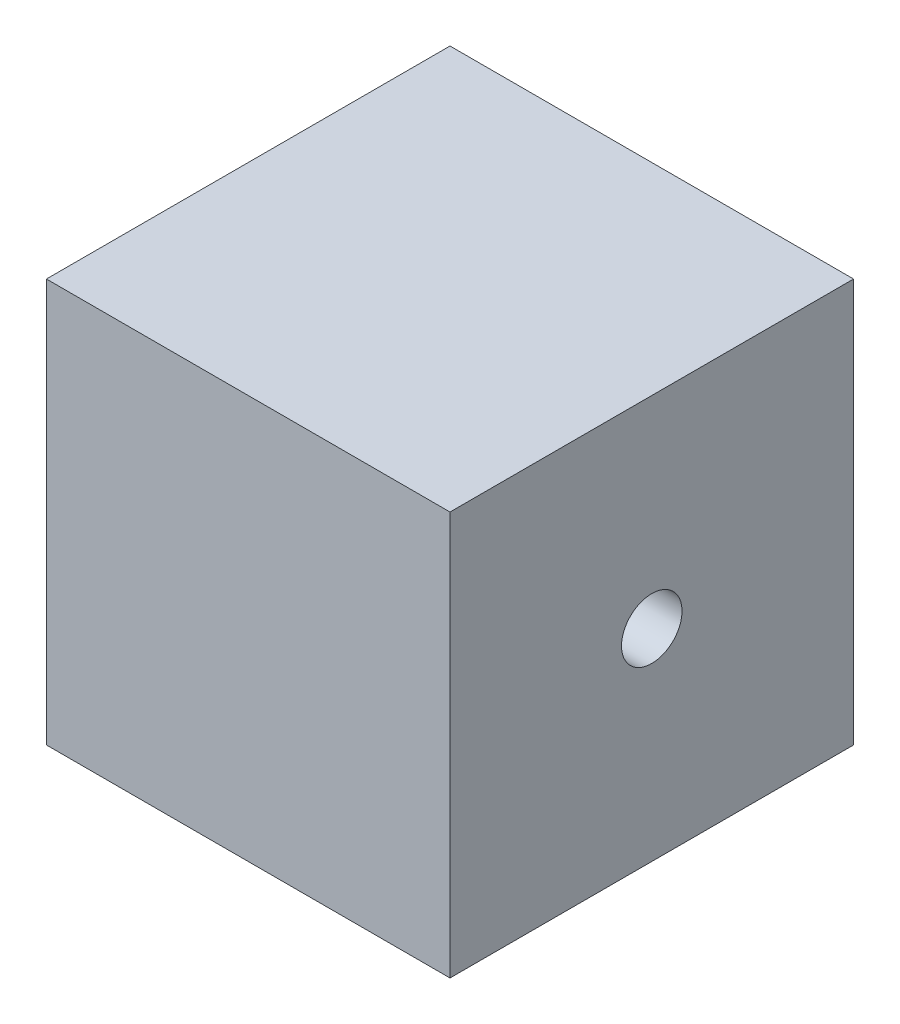
ISO-10303-21;
HEADER;
FILE_DESCRIPTION(('STEP AP214'),'2;1');
FILE_NAME('part.step','',(''),(''),'','','');
FILE_SCHEMA(('AUTOMOTIVE_DESIGN { 1 0 10303 214 1 1 1 1 }'));
ENDSEC;
DATA;
#1=APPLICATION_CONTEXT('core data for automotive mechanical design processes');
#2=APPLICATION_PROTOCOL_DEFINITION('international standard','automotive_design',2000,#1);
#3=PRODUCT_CONTEXT('',#1,'mechanical');
#4=PRODUCT('Part','Part','',(#3));
#5=PRODUCT_RELATED_PRODUCT_CATEGORY('part','',(#4));
#6=PRODUCT_DEFINITION_FORMATION('','',#4);
#7=PRODUCT_DEFINITION_CONTEXT('part definition',#1,'design');
#8=PRODUCT_DEFINITION('design','',#6,#7);
#9=PRODUCT_DEFINITION_SHAPE('','',#8);
#10=(LENGTH_UNIT() NAMED_UNIT(*) SI_UNIT(.MILLI.,.METRE.));
#11=(NAMED_UNIT(*) PLANE_ANGLE_UNIT() SI_UNIT($,.RADIAN.));
#12=(NAMED_UNIT(*) SI_UNIT($,.STERADIAN.) SOLID_ANGLE_UNIT());
#13=UNCERTAINTY_MEASURE_WITH_UNIT(LENGTH_MEASURE(1.E-05),#10,'distance_accuracy_value','');
#14=(GEOMETRIC_REPRESENTATION_CONTEXT(3) GLOBAL_UNCERTAINTY_ASSIGNED_CONTEXT((#13)) GLOBAL_UNIT_ASSIGNED_CONTEXT((#10,
#11,#12)) REPRESENTATION_CONTEXT('',''));
#15=CARTESIAN_POINT('',(0.,0.,0.));
#16=DIRECTION('',(0.,0.,1.));
#17=DIRECTION('',(1.,0.,0.));
#18=AXIS2_PLACEMENT_3D('',#15,#16,#17);
#19=CARTESIAN_POINT('',(-10.,20.,9.99999999999999));
#20=DIRECTION('',(1.,0.,0.));
#21=DIRECTION('',(0.,0.,-1.));
#22=AXIS2_PLACEMENT_3D('',#19,#20,#21);
#23=PLANE('',#22);
#24=CARTESIAN_POINT('',(-10.,10.,0.));
#25=DIRECTION('',(-1.,0.,0.));
#26=DIRECTION('',(0.,0.,1.));
#27=AXIS2_PLACEMENT_3D('',#24,#25,#26);
#28=CIRCLE('',#27,1.5);
#29=CARTESIAN_POINT('',(-10.,10.,1.5));
#30=VERTEX_POINT('',#29);
#31=EDGE_CURVE('E110',#30,#30,#28,.T.);
#32=ORIENTED_EDGE('',*,*,#31,.F.);
#33=EDGE_LOOP('',(#32));
#34=FACE_BOUND('',#33,.T.);
#35=DIRECTION('',(0.,0.,1.));
#36=VECTOR('',#35,1.);
#37=CARTESIAN_POINT('',(-10.,0.,9.99999999999999));
#38=LINE('',#37,#36);
#39=CARTESIAN_POINT('',(-10.,0.,-9.99999999999999));
#40=VERTEX_POINT('',#39);
#41=CARTESIAN_POINT('',(-10.,0.,9.99999999999999));
#42=VERTEX_POINT('',#41);
#43=EDGE_CURVE('E96',#40,#42,#38,.T.);
#44=ORIENTED_EDGE('',*,*,#43,.T.);
#45=DIRECTION('',(0.,-1.,0.));
#46=VECTOR('',#45,1.);
#47=CARTESIAN_POINT('',(-10.,20.,9.99999999999999));
#48=LINE('',#47,#46);
#49=CARTESIAN_POINT('',(-10.,20.,9.99999999999999));
#50=VERTEX_POINT('',#49);
#51=EDGE_CURVE('E11',#50,#42,#48,.T.);
#52=ORIENTED_EDGE('',*,*,#51,.F.);
#53=DIRECTION('',(0.,0.,1.));
#54=VECTOR('',#53,1.);
#55=CARTESIAN_POINT('',(-10.,20.,9.99999999999999));
#56=LINE('',#55,#54);
#57=CARTESIAN_POINT('',(-10.,20.,-9.99999999999999));
#58=VERTEX_POINT('',#57);
#59=EDGE_CURVE('E84',#58,#50,#56,.T.);
#60=ORIENTED_EDGE('',*,*,#59,.F.);
#61=DIRECTION('',(0.,-1.,0.));
#62=VECTOR('',#61,1.);
#63=CARTESIAN_POINT('',(-10.,20.,-9.99999999999999));
#64=LINE('',#63,#62);
#65=EDGE_CURVE('E92',#58,#40,#64,.T.);
#66=ORIENTED_EDGE('',*,*,#65,.T.);
#67=EDGE_LOOP('',(#44,#52,#60,#66));
#68=FACE_BOUND('',#67,.T.);
#69=ADVANCED_FACE('F33',(#34,#68),#23,.F.);
#70=CARTESIAN_POINT('',(10.,20.,9.99999999999999));
#71=DIRECTION('',(0.,0.,-1.));
#72=DIRECTION('',(-1.,0.,0.));
#73=AXIS2_PLACEMENT_3D('',#70,#71,#72);
#74=PLANE('',#73);
#75=DIRECTION('',(1.,0.,0.));
#76=VECTOR('',#75,1.);
#77=CARTESIAN_POINT('',(10.,0.,9.99999999999999));
#78=LINE('',#77,#76);
#79=CARTESIAN_POINT('',(10.,0.,9.99999999999999));
#80=VERTEX_POINT('',#79);
#81=EDGE_CURVE('E88',#42,#80,#78,.T.);
#82=ORIENTED_EDGE('',*,*,#81,.T.);
#83=DIRECTION('',(0.,-1.,0.));
#84=VECTOR('',#83,1.);
#85=CARTESIAN_POINT('',(10.,20.,9.99999999999999));
#86=LINE('',#85,#84);
#87=CARTESIAN_POINT('',(10.,20.,9.99999999999999));
#88=VERTEX_POINT('',#87);
#89=EDGE_CURVE('E41',#88,#80,#86,.T.);
#90=ORIENTED_EDGE('',*,*,#89,.F.);
#91=DIRECTION('',(1.,0.,0.));
#92=VECTOR('',#91,1.);
#93=CARTESIAN_POINT('',(10.,20.,9.99999999999999));
#94=LINE('',#93,#92);
#95=EDGE_CURVE('E79',#50,#88,#94,.T.);
#96=ORIENTED_EDGE('',*,*,#95,.F.);
#97=ORIENTED_EDGE('',*,*,#51,.T.);
#98=EDGE_LOOP('',(#82,#90,#96,#97));
#99=FACE_BOUND('',#98,.T.);
#100=ADVANCED_FACE('F87',(#99),#74,.F.);
#101=CARTESIAN_POINT('',(10.,20.,9.99999999999999));
#102=DIRECTION('',(-1.,0.,0.));
#103=DIRECTION('',(0.,0.,1.));
#104=AXIS2_PLACEMENT_3D('',#101,#102,#103);
#105=PLANE('',#104);
#106=CARTESIAN_POINT('',(10.,10.,0.));
#107=DIRECTION('',(-1.,0.,0.));
#108=DIRECTION('',(0.,0.,1.));
#109=AXIS2_PLACEMENT_3D('',#106,#107,#108);
#110=CIRCLE('',#109,1.5);
#111=CARTESIAN_POINT('',(10.,10.,1.5));
#112=VERTEX_POINT('',#111);
#113=EDGE_CURVE('E99',#112,#112,#110,.T.);
#114=ORIENTED_EDGE('',*,*,#113,.T.);
#115=EDGE_LOOP('',(#114));
#116=FACE_BOUND('',#115,.T.);
#117=DIRECTION('',(0.,0.,-1.));
#118=VECTOR('',#117,1.);
#119=CARTESIAN_POINT('',(10.,0.,9.99999999999999));
#120=LINE('',#119,#118);
#121=CARTESIAN_POINT('',(10.,0.,-9.99999999999999));
#122=VERTEX_POINT('',#121);
#123=EDGE_CURVE('E66',#80,#122,#120,.T.);
#124=ORIENTED_EDGE('',*,*,#123,.T.);
#125=DIRECTION('',(0.,-1.,0.));
#126=VECTOR('',#125,1.);
#127=CARTESIAN_POINT('',(10.,20.,-9.99999999999999));
#128=LINE('',#127,#126);
#129=CARTESIAN_POINT('',(10.,20.,-9.99999999999999));
#130=VERTEX_POINT('',#129);
#131=EDGE_CURVE('E89',#130,#122,#128,.T.);
#132=ORIENTED_EDGE('',*,*,#131,.F.);
#133=DIRECTION('',(0.,0.,-1.));
#134=VECTOR('',#133,1.);
#135=CARTESIAN_POINT('',(10.,20.,9.99999999999999));
#136=LINE('',#135,#134);
#137=EDGE_CURVE('E82',#88,#130,#136,.T.);
#138=ORIENTED_EDGE('',*,*,#137,.F.);
#139=ORIENTED_EDGE('',*,*,#89,.T.);
#140=EDGE_LOOP('',(#124,#132,#138,#139));
#141=FACE_BOUND('',#140,.T.);
#142=ADVANCED_FACE('F90',(#116,#141),#105,.F.);
#143=CARTESIAN_POINT('',(10.,20.,-9.99999999999999));
#144=DIRECTION('',(0.,0.,1.));
#145=DIRECTION('',(1.,0.,0.));
#146=AXIS2_PLACEMENT_3D('',#143,#144,#145);
#147=PLANE('',#146);
#148=DIRECTION('',(-1.,0.,0.));
#149=VECTOR('',#148,1.);
#150=CARTESIAN_POINT('',(10.,0.,-9.99999999999999));
#151=LINE('',#150,#149);
#152=EDGE_CURVE('E72',#122,#40,#151,.T.);
#153=ORIENTED_EDGE('',*,*,#152,.T.);
#154=ORIENTED_EDGE('',*,*,#65,.F.);
#155=DIRECTION('',(-1.,0.,0.));
#156=VECTOR('',#155,1.);
#157=CARTESIAN_POINT('',(10.,20.,-9.99999999999999));
#158=LINE('',#157,#156);
#159=EDGE_CURVE('E49',#130,#58,#158,.T.);
#160=ORIENTED_EDGE('',*,*,#159,.F.);
#161=ORIENTED_EDGE('',*,*,#131,.T.);
#162=EDGE_LOOP('',(#153,#154,#160,#161));
#163=FACE_BOUND('',#162,.T.);
#164=ADVANCED_FACE('F104',(#163),#147,.F.);
#165=CARTESIAN_POINT('',(0.,20.,0.));
#166=DIRECTION('',(0.,1.,0.));
#167=DIRECTION('',(0.,0.,1.));
#168=AXIS2_PLACEMENT_3D('',#165,#166,#167);
#169=PLANE('',#168);
#170=ORIENTED_EDGE('',*,*,#59,.T.);
#171=ORIENTED_EDGE('',*,*,#95,.T.);
#172=ORIENTED_EDGE('',*,*,#137,.T.);
#173=ORIENTED_EDGE('',*,*,#159,.T.);
#174=EDGE_LOOP('',(#170,#171,#172,#173));
#175=FACE_BOUND('',#174,.T.);
#176=ADVANCED_FACE('F80',(#175),#169,.T.);
#177=CARTESIAN_POINT('',(0.,0.,0.));
#178=DIRECTION('',(0.,1.,0.));
#179=DIRECTION('',(0.,0.,1.));
#180=AXIS2_PLACEMENT_3D('',#177,#178,#179);
#181=PLANE('',#180);
#182=ORIENTED_EDGE('',*,*,#43,.F.);
#183=ORIENTED_EDGE('',*,*,#152,.F.);
#184=ORIENTED_EDGE('',*,*,#123,.F.);
#185=ORIENTED_EDGE('',*,*,#81,.F.);
#186=EDGE_LOOP('',(#182,#183,#184,#185));
#187=FACE_BOUND('',#186,.T.);
#188=ADVANCED_FACE('F107',(#187),#181,.F.);
#189=CARTESIAN_POINT('',(10.,10.,0.));
#190=DIRECTION('',(-1.,0.,0.));
#191=DIRECTION('',(0.,0.,1.));
#192=AXIS2_PLACEMENT_3D('',#189,#190,#191);
#193=CYLINDRICAL_SURFACE('',#192,1.5);
#194=ORIENTED_EDGE('',*,*,#113,.F.);
#195=EDGE_LOOP('',(#194));
#196=FACE_BOUND('',#195,.T.);
#197=ORIENTED_EDGE('',*,*,#31,.T.);
#198=EDGE_LOOP('',(#197));
#199=FACE_BOUND('',#198,.T.);
#200=ADVANCED_FACE('F117',(#196,#199),#193,.F.);
#201=CLOSED_SHELL('',(#69,#100,#142,#164,#176,#188,#200));
#202=MANIFOLD_SOLID_BREP('B2',#201);
#203=ADVANCED_BREP_SHAPE_REPRESENTATION('',(#18,#202),#14);
#204=SHAPE_DEFINITION_REPRESENTATION(#9,#203);
ENDSEC;
END-ISO-10303-21;
